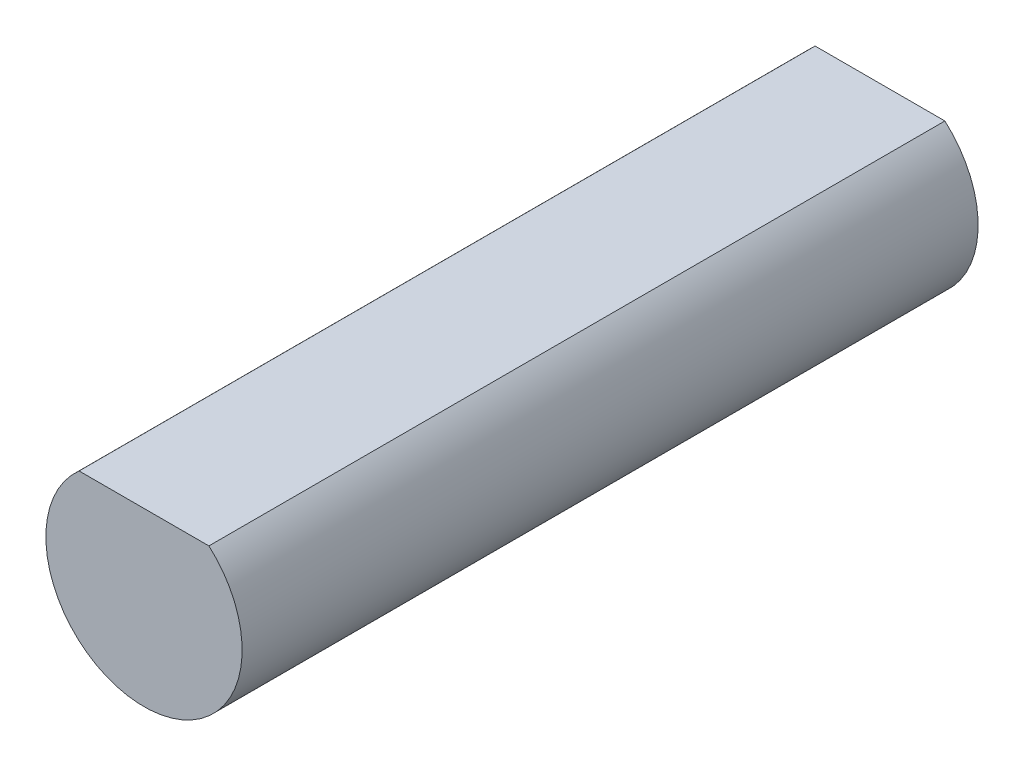
ISO-10303-21;
HEADER;
FILE_DESCRIPTION(('STEP AP214'),'2;1');
FILE_NAME('part.step','',(''),(''),'','','');
FILE_SCHEMA(('AUTOMOTIVE_DESIGN { 1 0 10303 214 1 1 1 1 }'));
ENDSEC;
DATA;
#1=APPLICATION_CONTEXT('core data for automotive mechanical design processes');
#2=APPLICATION_PROTOCOL_DEFINITION('international standard','automotive_design',2000,#1);
#3=PRODUCT_CONTEXT('',#1,'mechanical');
#4=PRODUCT('Part','Part','',(#3));
#5=PRODUCT_RELATED_PRODUCT_CATEGORY('part','',(#4));
#6=PRODUCT_DEFINITION_FORMATION('','',#4);
#7=PRODUCT_DEFINITION_CONTEXT('part definition',#1,'design');
#8=PRODUCT_DEFINITION('design','',#6,#7);
#9=PRODUCT_DEFINITION_SHAPE('','',#8);
#10=(LENGTH_UNIT() NAMED_UNIT(*) SI_UNIT(.MILLI.,.METRE.));
#11=(NAMED_UNIT(*) PLANE_ANGLE_UNIT() SI_UNIT($,.RADIAN.));
#12=(NAMED_UNIT(*) SI_UNIT($,.STERADIAN.) SOLID_ANGLE_UNIT());
#13=UNCERTAINTY_MEASURE_WITH_UNIT(LENGTH_MEASURE(1.E-05),#10,'distance_accuracy_value','');
#14=(GEOMETRIC_REPRESENTATION_CONTEXT(3) GLOBAL_UNCERTAINTY_ASSIGNED_CONTEXT((#13)) GLOBAL_UNIT_ASSIGNED_CONTEXT((#10,
#11,#12)) REPRESENTATION_CONTEXT('',''));
#15=CARTESIAN_POINT('',(0.,0.,0.));
#16=DIRECTION('',(0.,0.,1.));
#17=DIRECTION('',(1.,0.,0.));
#18=AXIS2_PLACEMENT_3D('',#15,#16,#17);
#19=CARTESIAN_POINT('',(0.,0.,15.));
#20=DIRECTION('',(0.,0.,-1.));
#21=DIRECTION('',(-1.,0.,0.));
#22=AXIS2_PLACEMENT_3D('',#19,#20,#21);
#23=CYLINDRICAL_SURFACE('',#22,2.);
#24=CARTESIAN_POINT('',(0.,0.,0.));
#25=DIRECTION('',(0.,0.,1.));
#26=DIRECTION('',(-1.,0.,0.));
#27=AXIS2_PLACEMENT_3D('',#24,#25,#26);
#28=CIRCLE('',#27,2.);
#29=CARTESIAN_POINT('',(-1.3228756555323,1.5,0.));
#30=VERTEX_POINT('',#29);
#31=CARTESIAN_POINT('',(1.3228756555323,1.5,0.));
#32=VERTEX_POINT('',#31);
#33=EDGE_CURVE('E72',#30,#32,#28,.T.);
#34=ORIENTED_EDGE('',*,*,#33,.T.);
#35=DIRECTION('',(0.,0.,-1.));
#36=VECTOR('',#35,1.);
#37=CARTESIAN_POINT('',(1.3228756555323,1.5,15.));
#38=LINE('',#37,#36);
#39=CARTESIAN_POINT('',(1.3228756555323,1.5,15.));
#40=VERTEX_POINT('',#39);
#41=EDGE_CURVE('E11',#40,#32,#38,.T.);
#42=ORIENTED_EDGE('',*,*,#41,.F.);
#43=CARTESIAN_POINT('',(0.,0.,15.));
#44=DIRECTION('',(0.,0.,1.));
#45=DIRECTION('',(-1.,0.,0.));
#46=AXIS2_PLACEMENT_3D('',#43,#44,#45);
#47=CIRCLE('',#46,2.);
#48=CARTESIAN_POINT('',(-1.3228756555323,1.5,15.));
#49=VERTEX_POINT('',#48);
#50=EDGE_CURVE('E71',#49,#40,#47,.T.);
#51=ORIENTED_EDGE('',*,*,#50,.F.);
#52=DIRECTION('',(0.,0.,-1.));
#53=VECTOR('',#52,1.);
#54=CARTESIAN_POINT('',(-1.3228756555323,1.5,15.));
#55=LINE('',#54,#53);
#56=EDGE_CURVE('E48',#49,#30,#55,.T.);
#57=ORIENTED_EDGE('',*,*,#56,.T.);
#58=EDGE_LOOP('',(#34,#42,#51,#57));
#59=FACE_BOUND('',#58,.T.);
#60=ADVANCED_FACE('F39',(#59),#23,.T.);
#61=CARTESIAN_POINT('',(-1.3228756555323,1.5,15.));
#62=DIRECTION('',(0.,-1.,0.));
#63=DIRECTION('',(0.,0.,-1.));
#64=AXIS2_PLACEMENT_3D('',#61,#62,#63);
#65=PLANE('',#64);
#66=DIRECTION('',(-1.,0.,0.));
#67=VECTOR('',#66,1.);
#68=CARTESIAN_POINT('',(-1.3228756555323,1.5,0.));
#69=LINE('',#68,#67);
#70=EDGE_CURVE('E63',#32,#30,#69,.T.);
#71=ORIENTED_EDGE('',*,*,#70,.T.);
#72=ORIENTED_EDGE('',*,*,#56,.F.);
#73=DIRECTION('',(-1.,0.,0.));
#74=VECTOR('',#73,1.);
#75=CARTESIAN_POINT('',(-1.3228756555323,1.5,15.));
#76=LINE('',#75,#74);
#77=EDGE_CURVE('E55',#40,#49,#76,.T.);
#78=ORIENTED_EDGE('',*,*,#77,.F.);
#79=ORIENTED_EDGE('',*,*,#41,.T.);
#80=EDGE_LOOP('',(#71,#72,#78,#79));
#81=FACE_BOUND('',#80,.T.);
#82=ADVANCED_FACE('F66',(#81),#65,.F.);
#83=CARTESIAN_POINT('',(0.,0.,15.));
#84=DIRECTION('',(0.,0.,-1.));
#85=DIRECTION('',(-1.,0.,0.));
#86=AXIS2_PLACEMENT_3D('',#83,#84,#85);
#87=PLANE('',#86);
#88=ORIENTED_EDGE('',*,*,#50,.T.);
#89=ORIENTED_EDGE('',*,*,#77,.T.);
#90=EDGE_LOOP('',(#88,#89));
#91=FACE_BOUND('',#90,.T.);
#92=ADVANCED_FACE('F83',(#91),#87,.F.);
#93=CARTESIAN_POINT('',(0.,0.,0.));
#94=DIRECTION('',(0.,0.,-1.));
#95=DIRECTION('',(-1.,0.,0.));
#96=AXIS2_PLACEMENT_3D('',#93,#94,#95);
#97=PLANE('',#96);
#98=ORIENTED_EDGE('',*,*,#33,.F.);
#99=ORIENTED_EDGE('',*,*,#70,.F.);
#100=EDGE_LOOP('',(#98,#99));
#101=FACE_BOUND('',#100,.T.);
#102=ADVANCED_FACE('F76',(#101),#97,.T.);
#103=CLOSED_SHELL('',(#60,#82,#92,#102));
#104=MANIFOLD_SOLID_BREP('B2',#103);
#105=ADVANCED_BREP_SHAPE_REPRESENTATION('',(#18,#104),#14);
#106=SHAPE_DEFINITION_REPRESENTATION(#9,#105);
ENDSEC;
END-ISO-10303-21;
